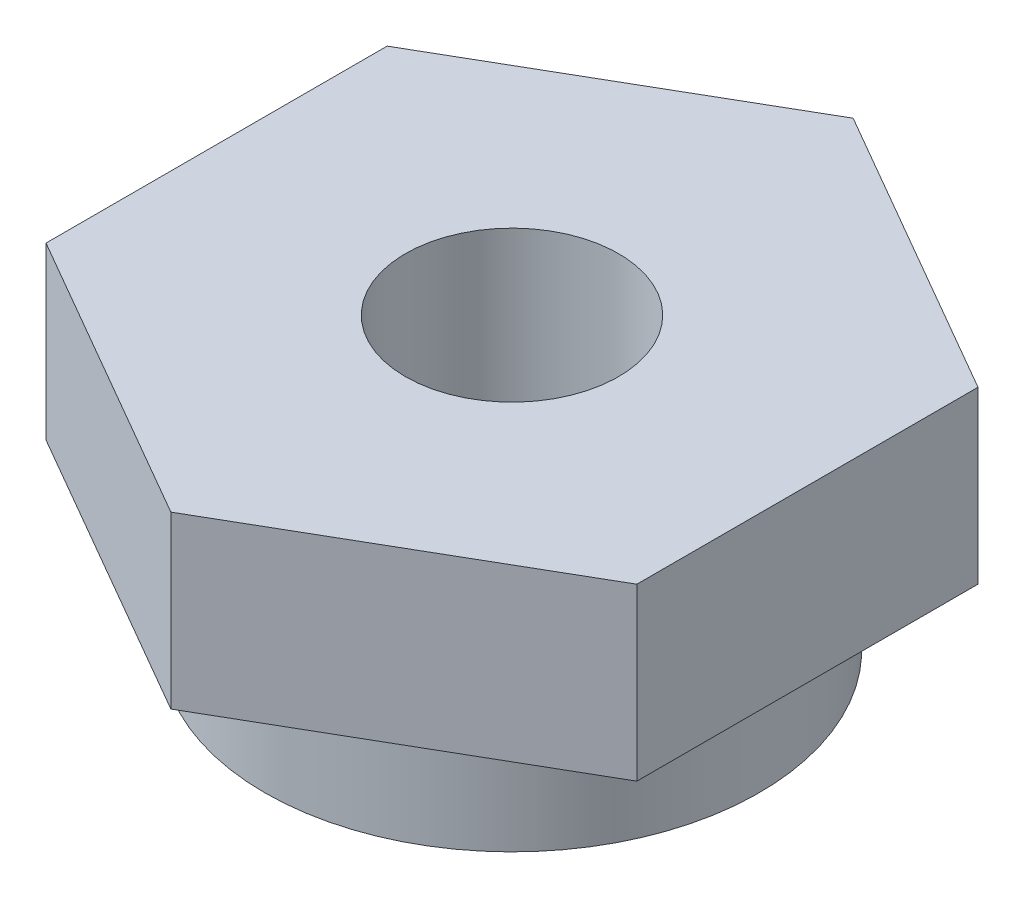
ISO-10303-21;
HEADER;
FILE_DESCRIPTION(('STEP AP214'),'2;1');
FILE_NAME('part.step','',(''),(''),'','','');
FILE_SCHEMA(('AUTOMOTIVE_DESIGN { 1 0 10303 214 1 1 1 1 }'));
ENDSEC;
DATA;
#1=APPLICATION_CONTEXT('core data for automotive mechanical design processes');
#2=APPLICATION_PROTOCOL_DEFINITION('international standard','automotive_design',2000,#1);
#3=PRODUCT_CONTEXT('',#1,'mechanical');
#4=PRODUCT('Part','Part','',(#3));
#5=PRODUCT_RELATED_PRODUCT_CATEGORY('part','',(#4));
#6=PRODUCT_DEFINITION_FORMATION('','',#4);
#7=PRODUCT_DEFINITION_CONTEXT('part definition',#1,'design');
#8=PRODUCT_DEFINITION('design','',#6,#7);
#9=PRODUCT_DEFINITION_SHAPE('','',#8);
#10=(LENGTH_UNIT() NAMED_UNIT(*) SI_UNIT(.MILLI.,.METRE.));
#11=(NAMED_UNIT(*) PLANE_ANGLE_UNIT() SI_UNIT($,.RADIAN.));
#12=(NAMED_UNIT(*) SI_UNIT($,.STERADIAN.) SOLID_ANGLE_UNIT());
#13=UNCERTAINTY_MEASURE_WITH_UNIT(LENGTH_MEASURE(1.E-05),#10,'distance_accuracy_value','');
#14=(GEOMETRIC_REPRESENTATION_CONTEXT(3) GLOBAL_UNCERTAINTY_ASSIGNED_CONTEXT((#13)) GLOBAL_UNIT_ASSIGNED_CONTEXT((#10,
#11,#12)) REPRESENTATION_CONTEXT('',''));
#15=CARTESIAN_POINT('',(0.,0.,0.));
#16=DIRECTION('',(0.,0.,1.));
#17=DIRECTION('',(1.,0.,0.));
#18=AXIS2_PLACEMENT_3D('',#15,#16,#17);
#19=CARTESIAN_POINT('',(0.,0.,0.));
#20=DIRECTION('',(0.,1.,0.));
#21=DIRECTION('',(0.,0.,1.));
#22=AXIS2_PLACEMENT_3D('',#19,#20,#21);
#23=PLANE('',#22);
#24=CARTESIAN_POINT('',(0.,0.,0.));
#25=DIRECTION('',(0.,1.,0.));
#26=DIRECTION('',(0.,0.,1.));
#27=AXIS2_PLACEMENT_3D('',#24,#25,#26);
#28=CIRCLE('',#27,9.2075);
#29=CARTESIAN_POINT('',(0.,0.,9.2075));
#30=VERTEX_POINT('',#29);
#31=EDGE_CURVE('E37',#30,#30,#28,.T.);
#32=ORIENTED_EDGE('',*,*,#31,.F.);
#33=EDGE_LOOP('',(#32));
#34=FACE_BOUND('',#33,.T.);
#35=CARTESIAN_POINT('',(0.,0.,0.));
#36=DIRECTION('',(0.,1.,0.));
#37=DIRECTION('',(0.,0.,1.));
#38=AXIS2_PLACEMENT_3D('',#35,#36,#37);
#39=CIRCLE('',#38,3.96875);
#40=CARTESIAN_POINT('',(0.,0.,3.96875));
#41=VERTEX_POINT('',#40);
#42=EDGE_CURVE('E140',#41,#41,#39,.T.);
#43=ORIENTED_EDGE('',*,*,#42,.T.);
#44=EDGE_LOOP('',(#43));
#45=FACE_BOUND('',#44,.T.);
#46=ADVANCED_FACE('F33',(#34,#45),#23,.F.);
#47=CARTESIAN_POINT('',(0.,4.445,0.));
#48=DIRECTION('',(0.,-1.,0.));
#49=DIRECTION('',(0.,0.,-1.));
#50=AXIS2_PLACEMENT_3D('',#47,#48,#49);
#51=CYLINDRICAL_SURFACE('',#50,9.2075);
#52=CARTESIAN_POINT('',(0.,4.445,0.));
#53=DIRECTION('',(0.,1.,0.));
#54=DIRECTION('',(0.,0.,1.));
#55=AXIS2_PLACEMENT_3D('',#52,#53,#54);
#56=CIRCLE('',#55,9.2075);
#57=CARTESIAN_POINT('',(0.,4.445,9.2075));
#58=VERTEX_POINT('',#57);
#59=EDGE_CURVE('E11',#58,#58,#56,.T.);
#60=ORIENTED_EDGE('',*,*,#59,.F.);
#61=EDGE_LOOP('',(#60));
#62=FACE_BOUND('',#61,.T.);
#63=ORIENTED_EDGE('',*,*,#31,.T.);
#64=EDGE_LOOP('',(#63));
#65=FACE_BOUND('',#64,.T.);
#66=ADVANCED_FACE('F35',(#62,#65),#51,.T.);
#67=CARTESIAN_POINT('',(0.,4.445,0.));
#68=DIRECTION('',(0.,-1.,0.));
#69=DIRECTION('',(0.,0.,-1.));
#70=AXIS2_PLACEMENT_3D('',#67,#68,#69);
#71=CYLINDRICAL_SURFACE('',#70,3.96875);
#72=ORIENTED_EDGE('',*,*,#42,.F.);
#73=EDGE_LOOP('',(#72));
#74=FACE_BOUND('',#73,.T.);
#75=CARTESIAN_POINT('',(0.,10.795,0.));
#76=DIRECTION('',(0.,1.,0.));
#77=DIRECTION('',(0.,0.,1.));
#78=AXIS2_PLACEMENT_3D('',#75,#76,#77);
#79=CIRCLE('',#78,3.96875);
#80=CARTESIAN_POINT('',(0.,10.795,3.96875));
#81=VERTEX_POINT('',#80);
#82=EDGE_CURVE('E124',#81,#81,#79,.T.);
#83=ORIENTED_EDGE('',*,*,#82,.T.);
#84=EDGE_LOOP('',(#83));
#85=FACE_BOUND('',#84,.T.);
#86=ADVANCED_FACE('F152',(#74,#85),#71,.F.);
#87=CARTESIAN_POINT('',(0.,10.795,0.));
#88=DIRECTION('',(0.,1.,0.));
#89=DIRECTION('',(0.,0.,1.));
#90=AXIS2_PLACEMENT_3D('',#87,#88,#89);
#91=PLANE('',#90);
#92=DIRECTION('',(-0.866025403784439,0.,-0.5));
#93=VECTOR('',#92,1.);
#94=CARTESIAN_POINT('',(10.9985226280624,10.795,-6.35));
#95=LINE('',#94,#93);
#96=CARTESIAN_POINT('',(10.9985226280624,10.795,-6.35));
#97=VERTEX_POINT('',#96);
#98=CARTESIAN_POINT('',(0.,10.795,-12.7));
#99=VERTEX_POINT('',#98);
#100=EDGE_CURVE('E131',#97,#99,#95,.T.);
#101=ORIENTED_EDGE('',*,*,#100,.T.);
#102=DIRECTION('',(-0.866025403784439,0.,0.5));
#103=VECTOR('',#102,1.);
#104=CARTESIAN_POINT('',(0.,10.795,-12.7));
#105=LINE('',#104,#103);
#106=CARTESIAN_POINT('',(-10.9985226280624,10.795,-6.35));
#107=VERTEX_POINT('',#106);
#108=EDGE_CURVE('E88',#99,#107,#105,.T.);
#109=ORIENTED_EDGE('',*,*,#108,.T.);
#110=DIRECTION('',(0.,0.,1.));
#111=VECTOR('',#110,1.);
#112=CARTESIAN_POINT('',(-10.9985226280624,10.795,-6.35));
#113=LINE('',#112,#111);
#114=CARTESIAN_POINT('',(-10.9985226280624,10.795,6.35));
#115=VERTEX_POINT('',#114);
#116=EDGE_CURVE('E102',#107,#115,#113,.T.);
#117=ORIENTED_EDGE('',*,*,#116,.T.);
#118=DIRECTION('',(0.866025403784439,0.,0.5));
#119=VECTOR('',#118,1.);
#120=CARTESIAN_POINT('',(-10.9985226280624,10.795,6.35));
#121=LINE('',#120,#119);
#122=CARTESIAN_POINT('',(0.,10.795,12.7));
#123=VERTEX_POINT('',#122);
#124=EDGE_CURVE('E95',#115,#123,#121,.T.);
#125=ORIENTED_EDGE('',*,*,#124,.T.);
#126=DIRECTION('',(0.866025403784439,0.,-0.5));
#127=VECTOR('',#126,1.);
#128=CARTESIAN_POINT('',(0.,10.795,12.7));
#129=LINE('',#128,#127);
#130=CARTESIAN_POINT('',(10.9985226280624,10.795,6.35));
#131=VERTEX_POINT('',#130);
#132=EDGE_CURVE('E100',#123,#131,#129,.T.);
#133=ORIENTED_EDGE('',*,*,#132,.T.);
#134=DIRECTION('',(0.,0.,-1.));
#135=VECTOR('',#134,1.);
#136=CARTESIAN_POINT('',(10.9985226280624,10.795,6.35));
#137=LINE('',#136,#135);
#138=EDGE_CURVE('E50',#131,#97,#137,.T.);
#139=ORIENTED_EDGE('',*,*,#138,.T.);
#140=EDGE_LOOP('',(#101,#109,#117,#125,#133,#139));
#141=FACE_BOUND('',#140,.T.);
#142=ORIENTED_EDGE('',*,*,#82,.F.);
#143=EDGE_LOOP('',(#142));
#144=FACE_BOUND('',#143,.T.);
#145=ADVANCED_FACE('F97',(#141,#144),#91,.T.);
#146=CARTESIAN_POINT('',(0.,4.445,0.));
#147=DIRECTION('',(0.,1.,0.));
#148=DIRECTION('',(0.,0.,1.));
#149=AXIS2_PLACEMENT_3D('',#146,#147,#148);
#150=PLANE('',#149);
#151=ORIENTED_EDGE('',*,*,#59,.T.);
#152=EDGE_LOOP('',(#151));
#153=FACE_BOUND('',#152,.T.);
#154=DIRECTION('',(-0.866025403784439,0.,-0.5));
#155=VECTOR('',#154,1.);
#156=CARTESIAN_POINT('',(10.9985226280624,4.445,-6.35));
#157=LINE('',#156,#155);
#158=CARTESIAN_POINT('',(10.9985226280624,4.445,-6.35));
#159=VERTEX_POINT('',#158);
#160=CARTESIAN_POINT('',(0.,4.445,-12.7));
#161=VERTEX_POINT('',#160);
#162=EDGE_CURVE('E120',#159,#161,#157,.T.);
#163=ORIENTED_EDGE('',*,*,#162,.F.);
#164=DIRECTION('',(0.,0.,-1.));
#165=VECTOR('',#164,1.);
#166=CARTESIAN_POINT('',(10.9985226280624,4.445,6.35));
#167=LINE('',#166,#165);
#168=CARTESIAN_POINT('',(10.9985226280624,4.445,6.35));
#169=VERTEX_POINT('',#168);
#170=EDGE_CURVE('E79',#169,#159,#167,.T.);
#171=ORIENTED_EDGE('',*,*,#170,.F.);
#172=DIRECTION('',(0.866025403784439,0.,-0.5));
#173=VECTOR('',#172,1.);
#174=CARTESIAN_POINT('',(0.,4.445,12.7));
#175=LINE('',#174,#173);
#176=CARTESIAN_POINT('',(0.,4.445,12.7));
#177=VERTEX_POINT('',#176);
#178=EDGE_CURVE('E73',#177,#169,#175,.T.);
#179=ORIENTED_EDGE('',*,*,#178,.F.);
#180=DIRECTION('',(0.866025403784439,0.,0.5));
#181=VECTOR('',#180,1.);
#182=CARTESIAN_POINT('',(-10.9985226280624,4.445,6.35));
#183=LINE('',#182,#181);
#184=CARTESIAN_POINT('',(-10.9985226280624,4.445,6.35));
#185=VERTEX_POINT('',#184);
#186=EDGE_CURVE('E110',#185,#177,#183,.T.);
#187=ORIENTED_EDGE('',*,*,#186,.F.);
#188=DIRECTION('',(0.,0.,1.));
#189=VECTOR('',#188,1.);
#190=CARTESIAN_POINT('',(-10.9985226280624,4.445,-6.35));
#191=LINE('',#190,#189);
#192=CARTESIAN_POINT('',(-10.9985226280624,4.445,-6.35));
#193=VERTEX_POINT('',#192);
#194=EDGE_CURVE('E126',#193,#185,#191,.T.);
#195=ORIENTED_EDGE('',*,*,#194,.F.);
#196=DIRECTION('',(-0.866025403784439,0.,0.5));
#197=VECTOR('',#196,1.);
#198=CARTESIAN_POINT('',(0.,4.445,-12.7));
#199=LINE('',#198,#197);
#200=EDGE_CURVE('E123',#161,#193,#199,.T.);
#201=ORIENTED_EDGE('',*,*,#200,.F.);
#202=EDGE_LOOP('',(#163,#171,#179,#187,#195,#201));
#203=FACE_BOUND('',#202,.T.);
#204=ADVANCED_FACE('F162',(#153,#203),#150,.F.);
#205=CARTESIAN_POINT('',(10.9985226280624,10.795,-6.35));
#206=DIRECTION('',(-0.5,0.,0.866025403784439));
#207=DIRECTION('',(0.866025403784439,0.,0.5));
#208=AXIS2_PLACEMENT_3D('',#205,#206,#207);
#209=PLANE('',#208);
#210=ORIENTED_EDGE('',*,*,#162,.T.);
#211=DIRECTION('',(0.,-1.,0.));
#212=VECTOR('',#211,1.);
#213=CARTESIAN_POINT('',(0.,10.795,-12.7));
#214=LINE('',#213,#212);
#215=EDGE_CURVE('E138',#99,#161,#214,.T.);
#216=ORIENTED_EDGE('',*,*,#215,.F.);
#217=ORIENTED_EDGE('',*,*,#100,.F.);
#218=DIRECTION('',(0.,-1.,0.));
#219=VECTOR('',#218,1.);
#220=CARTESIAN_POINT('',(10.9985226280624,10.795,-6.35));
#221=LINE('',#220,#219);
#222=EDGE_CURVE('E116',#97,#159,#221,.T.);
#223=ORIENTED_EDGE('',*,*,#222,.T.);
#224=EDGE_LOOP('',(#210,#216,#217,#223));
#225=FACE_BOUND('',#224,.T.);
#226=ADVANCED_FACE('F158',(#225),#209,.F.);
#227=CARTESIAN_POINT('',(0.,10.795,-12.7));
#228=DIRECTION('',(0.5,0.,0.866025403784439));
#229=DIRECTION('',(0.866025403784439,0.,-0.5));
#230=AXIS2_PLACEMENT_3D('',#227,#228,#229);
#231=PLANE('',#230);
#232=ORIENTED_EDGE('',*,*,#200,.T.);
#233=DIRECTION('',(0.,-1.,0.));
#234=VECTOR('',#233,1.);
#235=CARTESIAN_POINT('',(-10.9985226280624,10.795,-6.35));
#236=LINE('',#235,#234);
#237=EDGE_CURVE('E135',#107,#193,#236,.T.);
#238=ORIENTED_EDGE('',*,*,#237,.F.);
#239=ORIENTED_EDGE('',*,*,#108,.F.);
#240=ORIENTED_EDGE('',*,*,#215,.T.);
#241=EDGE_LOOP('',(#232,#238,#239,#240));
#242=FACE_BOUND('',#241,.T.);
#243=ADVANCED_FACE('F161',(#242),#231,.F.);
#244=CARTESIAN_POINT('',(-10.9985226280624,10.795,-6.35));
#245=DIRECTION('',(1.,0.,0.));
#246=DIRECTION('',(0.,0.,-1.));
#247=AXIS2_PLACEMENT_3D('',#244,#245,#246);
#248=PLANE('',#247);
#249=ORIENTED_EDGE('',*,*,#194,.T.);
#250=DIRECTION('',(0.,-1.,0.));
#251=VECTOR('',#250,1.);
#252=CARTESIAN_POINT('',(-10.9985226280624,10.795,6.35));
#253=LINE('',#252,#251);
#254=EDGE_CURVE('E111',#115,#185,#253,.T.);
#255=ORIENTED_EDGE('',*,*,#254,.F.);
#256=ORIENTED_EDGE('',*,*,#116,.F.);
#257=ORIENTED_EDGE('',*,*,#237,.T.);
#258=EDGE_LOOP('',(#249,#255,#256,#257));
#259=FACE_BOUND('',#258,.T.);
#260=ADVANCED_FACE('F166',(#259),#248,.F.);
#261=CARTESIAN_POINT('',(-10.9985226280624,10.795,6.35));
#262=DIRECTION('',(0.5,0.,-0.866025403784439));
#263=DIRECTION('',(-0.866025403784439,0.,-0.5));
#264=AXIS2_PLACEMENT_3D('',#261,#262,#263);
#265=PLANE('',#264);
#266=ORIENTED_EDGE('',*,*,#186,.T.);
#267=DIRECTION('',(0.,-1.,0.));
#268=VECTOR('',#267,1.);
#269=CARTESIAN_POINT('',(0.,10.795,12.7));
#270=LINE('',#269,#268);
#271=EDGE_CURVE('E107',#123,#177,#270,.T.);
#272=ORIENTED_EDGE('',*,*,#271,.F.);
#273=ORIENTED_EDGE('',*,*,#124,.F.);
#274=ORIENTED_EDGE('',*,*,#254,.T.);
#275=EDGE_LOOP('',(#266,#272,#273,#274));
#276=FACE_BOUND('',#275,.T.);
#277=ADVANCED_FACE('F108',(#276),#265,.F.);
#278=CARTESIAN_POINT('',(0.,10.795,12.7));
#279=DIRECTION('',(-0.5,0.,-0.866025403784439));
#280=DIRECTION('',(-0.866025403784439,0.,0.5));
#281=AXIS2_PLACEMENT_3D('',#278,#279,#280);
#282=PLANE('',#281);
#283=ORIENTED_EDGE('',*,*,#178,.T.);
#284=DIRECTION('',(0.,-1.,0.));
#285=VECTOR('',#284,1.);
#286=CARTESIAN_POINT('',(10.9985226280624,10.795,6.35));
#287=LINE('',#286,#285);
#288=EDGE_CURVE('E112',#131,#169,#287,.T.);
#289=ORIENTED_EDGE('',*,*,#288,.F.);
#290=ORIENTED_EDGE('',*,*,#132,.F.);
#291=ORIENTED_EDGE('',*,*,#271,.T.);
#292=EDGE_LOOP('',(#283,#289,#290,#291));
#293=FACE_BOUND('',#292,.T.);
#294=ADVANCED_FACE('F114',(#293),#282,.F.);
#295=CARTESIAN_POINT('',(10.9985226280624,10.795,6.35));
#296=DIRECTION('',(-1.,0.,0.));
#297=DIRECTION('',(0.,0.,1.));
#298=AXIS2_PLACEMENT_3D('',#295,#296,#297);
#299=PLANE('',#298);
#300=ORIENTED_EDGE('',*,*,#170,.T.);
#301=ORIENTED_EDGE('',*,*,#222,.F.);
#302=ORIENTED_EDGE('',*,*,#138,.F.);
#303=ORIENTED_EDGE('',*,*,#288,.T.);
#304=EDGE_LOOP('',(#300,#301,#302,#303));
#305=FACE_BOUND('',#304,.T.);
#306=ADVANCED_FACE('F174',(#305),#299,.F.);
#307=CLOSED_SHELL('',(#46,#66,#86,#145,#204,#226,#243,#260,#277,#294,#306));
#308=MANIFOLD_SOLID_BREP('B2',#307);
#309=ADVANCED_BREP_SHAPE_REPRESENTATION('',(#18,#308),#14);
#310=SHAPE_DEFINITION_REPRESENTATION(#9,#309);
ENDSEC;
END-ISO-10303-21;
